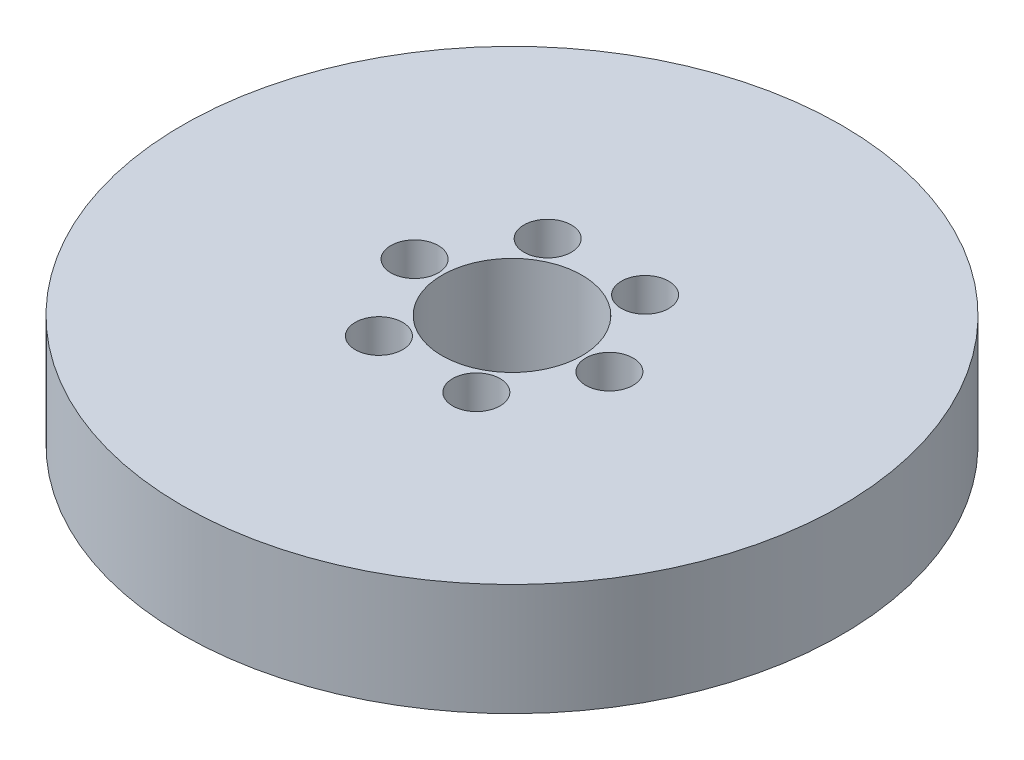
ISO-10303-21;
HEADER;
FILE_DESCRIPTION(('STEP AP214'),'2;1');
FILE_NAME('part.step','',(''),(''),'','','');
FILE_SCHEMA(('AUTOMOTIVE_DESIGN { 1 0 10303 214 1 1 1 1 }'));
ENDSEC;
DATA;
#1=APPLICATION_CONTEXT('core data for automotive mechanical design processes');
#2=APPLICATION_PROTOCOL_DEFINITION('international standard','automotive_design',2000,#1);
#3=PRODUCT_CONTEXT('',#1,'mechanical');
#4=PRODUCT('Part','Part','',(#3));
#5=PRODUCT_RELATED_PRODUCT_CATEGORY('part','',(#4));
#6=PRODUCT_DEFINITION_FORMATION('','',#4);
#7=PRODUCT_DEFINITION_CONTEXT('part definition',#1,'design');
#8=PRODUCT_DEFINITION('design','',#6,#7);
#9=PRODUCT_DEFINITION_SHAPE('','',#8);
#10=(LENGTH_UNIT() NAMED_UNIT(*) SI_UNIT(.MILLI.,.METRE.));
#11=(NAMED_UNIT(*) PLANE_ANGLE_UNIT() SI_UNIT($,.RADIAN.));
#12=(NAMED_UNIT(*) SI_UNIT($,.STERADIAN.) SOLID_ANGLE_UNIT());
#13=UNCERTAINTY_MEASURE_WITH_UNIT(LENGTH_MEASURE(1.E-05),#10,'distance_accuracy_value','');
#14=(GEOMETRIC_REPRESENTATION_CONTEXT(3) GLOBAL_UNCERTAINTY_ASSIGNED_CONTEXT((#13)) GLOBAL_UNIT_ASSIGNED_CONTEXT((#10,
#11,#12)) REPRESENTATION_CONTEXT('',''));
#15=CARTESIAN_POINT('',(0.,0.,0.));
#16=DIRECTION('',(0.,0.,1.));
#17=DIRECTION('',(1.,0.,0.));
#18=AXIS2_PLACEMENT_3D('',#15,#16,#17);
#19=CARTESIAN_POINT('',(0.,28.,0.));
#20=DIRECTION('',(0.,-1.,0.));
#21=DIRECTION('',(0.,0.,-1.));
#22=AXIS2_PLACEMENT_3D('',#19,#20,#21);
#23=CYLINDRICAL_SURFACE('',#22,82.5);
#24=CARTESIAN_POINT('',(0.,28.,0.));
#25=DIRECTION('',(0.,1.,0.));
#26=DIRECTION('',(0.,0.,1.));
#27=AXIS2_PLACEMENT_3D('',#24,#25,#26);
#28=CIRCLE('',#27,82.5);
#29=CARTESIAN_POINT('',(0.,28.,82.5));
#30=VERTEX_POINT('',#29);
#31=EDGE_CURVE('E10',#30,#30,#28,.T.);
#32=ORIENTED_EDGE('',*,*,#31,.F.);
#33=EDGE_LOOP('',(#32));
#34=FACE_BOUND('',#33,.T.);
#35=CARTESIAN_POINT('',(0.,0.,0.));
#36=DIRECTION('',(0.,1.,0.));
#37=DIRECTION('',(0.,0.,1.));
#38=AXIS2_PLACEMENT_3D('',#35,#36,#37);
#39=CIRCLE('',#38,82.5);
#40=CARTESIAN_POINT('',(0.,0.,82.5));
#41=VERTEX_POINT('',#40);
#42=EDGE_CURVE('E37',#41,#41,#39,.T.);
#43=ORIENTED_EDGE('',*,*,#42,.T.);
#44=EDGE_LOOP('',(#43));
#45=FACE_BOUND('',#44,.T.);
#46=ADVANCED_FACE('F40',(#34,#45),#23,.T.);
#47=CARTESIAN_POINT('',(0.,28.,0.));
#48=DIRECTION('',(0.,1.,0.));
#49=DIRECTION('',(0.,0.,1.));
#50=AXIS2_PLACEMENT_3D('',#47,#48,#49);
#51=PLANE('',#50);
#52=CARTESIAN_POINT('',(-12.1936646196493,28.,-21.1200466516871));
#53=DIRECTION('',(0.,1.,0.));
#54=DIRECTION('',(-0.866025403784433,0.,0.50000000000001));
#55=AXIS2_PLACEMENT_3D('',#52,#53,#54);
#56=CIRCLE('',#55,5.93664104178131);
#57=CARTESIAN_POINT('',(-17.3349465749812,28.,-18.1517261307964));
#58=VERTEX_POINT('',#57);
#59=EDGE_CURVE('E70',#58,#58,#56,.T.);
#60=ORIENTED_EDGE('',*,*,#59,.F.);
#61=EDGE_LOOP('',(#60));
#62=FACE_BOUND('',#61,.T.);
#63=CARTESIAN_POINT('',(12.1936646196489,28.,-21.1200466516873));
#64=DIRECTION('',(0.,1.,0.));
#65=DIRECTION('',(-0.866025403784443,0.,-0.499999999999992));
#66=AXIS2_PLACEMENT_3D('',#63,#64,#65);
#67=CIRCLE('',#66,5.93664104178131);
#68=CARTESIAN_POINT('',(7.05238266431691,28.,-24.0883671725779));
#69=VERTEX_POINT('',#68);
#70=EDGE_CURVE('E71',#69,#69,#67,.T.);
#71=ORIENTED_EDGE('',*,*,#70,.F.);
#72=EDGE_LOOP('',(#71));
#73=FACE_BOUND('',#72,.T.);
#74=CARTESIAN_POINT('',(24.3873292392981,28.,0.));
#75=DIRECTION('',(0.,1.,0.));
#76=DIRECTION('',(0.,0.,-1.));
#77=AXIS2_PLACEMENT_3D('',#74,#75,#76);
#78=CIRCLE('',#77,5.93664104178131);
#79=CARTESIAN_POINT('',(24.3873292392981,28.,-5.93664104178131));
#80=VERTEX_POINT('',#79);
#81=EDGE_CURVE('E78',#80,#80,#78,.T.);
#82=ORIENTED_EDGE('',*,*,#81,.F.);
#83=EDGE_LOOP('',(#82));
#84=FACE_BOUND('',#83,.T.);
#85=CARTESIAN_POINT('',(12.1936646196492,28.,21.1200466516872));
#86=DIRECTION('',(0.,1.,0.));
#87=DIRECTION('',(0.866025403784436,0.,-0.500000000000004));
#88=AXIS2_PLACEMENT_3D('',#85,#86,#87);
#89=CIRCLE('',#88,5.93664104178131);
#90=CARTESIAN_POINT('',(17.3349465749811,28.,18.1517261307965));
#91=VERTEX_POINT('',#90);
#92=EDGE_CURVE('E84',#91,#91,#89,.T.);
#93=ORIENTED_EDGE('',*,*,#92,.F.);
#94=EDGE_LOOP('',(#93));
#95=FACE_BOUND('',#94,.T.);
#96=CARTESIAN_POINT('',(-12.193664619649,28.,21.1200466516872));
#97=DIRECTION('',(0.,1.,0.));
#98=DIRECTION('',(0.86602540378444,0.,0.499999999999998));
#99=AXIS2_PLACEMENT_3D('',#96,#97,#98);
#100=CIRCLE('',#99,5.93664104178131);
#101=CARTESIAN_POINT('',(-7.05238266431708,28.,24.0883671725779));
#102=VERTEX_POINT('',#101);
#103=EDGE_CURVE('E61',#102,#102,#100,.T.);
#104=ORIENTED_EDGE('',*,*,#103,.F.);
#105=EDGE_LOOP('',(#104));
#106=FACE_BOUND('',#105,.T.);
#107=CARTESIAN_POINT('',(-24.3873292392981,28.,0.));
#108=DIRECTION('',(0.,1.,0.));
#109=DIRECTION('',(0.,0.,1.));
#110=AXIS2_PLACEMENT_3D('',#107,#108,#109);
#111=CIRCLE('',#110,5.93664104178131);
#112=CARTESIAN_POINT('',(-24.3873292392981,28.,5.93664104178131));
#113=VERTEX_POINT('',#112);
#114=EDGE_CURVE('E54',#113,#113,#111,.T.);
#115=ORIENTED_EDGE('',*,*,#114,.F.);
#116=EDGE_LOOP('',(#115));
#117=FACE_BOUND('',#116,.T.);
#118=CARTESIAN_POINT('',(0.,28.,0.));
#119=DIRECTION('',(0.,1.,0.));
#120=DIRECTION('',(0.,0.,1.));
#121=AXIS2_PLACEMENT_3D('',#118,#119,#120);
#122=CIRCLE('',#121,17.5);
#123=CARTESIAN_POINT('',(0.,28.,17.5));
#124=VERTEX_POINT('',#123);
#125=EDGE_CURVE('E50',#124,#124,#122,.T.);
#126=ORIENTED_EDGE('',*,*,#125,.F.);
#127=EDGE_LOOP('',(#126));
#128=FACE_BOUND('',#127,.T.);
#129=ORIENTED_EDGE('',*,*,#31,.T.);
#130=EDGE_LOOP('',(#129));
#131=FACE_BOUND('',#130,.T.);
#132=ADVANCED_FACE('F99',(#62,#73,#84,#95,#106,#117,#128,#131),#51,.T.);
#133=CARTESIAN_POINT('',(0.,0.,0.));
#134=DIRECTION('',(0.,1.,0.));
#135=DIRECTION('',(0.,0.,1.));
#136=AXIS2_PLACEMENT_3D('',#133,#134,#135);
#137=PLANE('',#136);
#138=CARTESIAN_POINT('',(0.,0.,0.));
#139=DIRECTION('',(0.,1.,0.));
#140=DIRECTION('',(0.,0.,1.));
#141=AXIS2_PLACEMENT_3D('',#138,#139,#140);
#142=CIRCLE('',#141,17.5);
#143=CARTESIAN_POINT('',(0.,0.,17.5));
#144=VERTEX_POINT('',#143);
#145=EDGE_CURVE('E47',#144,#144,#142,.T.);
#146=ORIENTED_EDGE('',*,*,#145,.T.);
#147=EDGE_LOOP('',(#146));
#148=FACE_BOUND('',#147,.T.);
#149=ORIENTED_EDGE('',*,*,#42,.F.);
#150=EDGE_LOOP('',(#149));
#151=FACE_BOUND('',#150,.T.);
#152=ADVANCED_FACE('F103',(#148,#151),#137,.F.);
#153=CARTESIAN_POINT('',(0.,28.,0.));
#154=DIRECTION('',(0.,-1.,0.));
#155=DIRECTION('',(0.,0.,-1.));
#156=AXIS2_PLACEMENT_3D('',#153,#154,#155);
#157=CYLINDRICAL_SURFACE('',#156,17.5);
#158=ORIENTED_EDGE('',*,*,#125,.T.);
#159=EDGE_LOOP('',(#158));
#160=FACE_BOUND('',#159,.T.);
#161=ORIENTED_EDGE('',*,*,#145,.F.);
#162=EDGE_LOOP('',(#161));
#163=FACE_BOUND('',#162,.T.);
#164=ADVANCED_FACE('F115',(#160,#163),#157,.F.);
#165=CARTESIAN_POINT('',(-24.3873292392981,9.53232784157378,0.));
#166=DIRECTION('',(0.,1.,0.));
#167=DIRECTION('',(0.,0.,1.));
#168=AXIS2_PLACEMENT_3D('',#165,#166,#167);
#169=CYLINDRICAL_SURFACE('',#168,5.93664104178131);
#170=CARTESIAN_POINT('',(-24.3873292392981,9.53232784157378,0.));
#171=DIRECTION('',(0.,1.,0.));
#172=DIRECTION('',(0.,0.,1.));
#173=AXIS2_PLACEMENT_3D('',#170,#171,#172);
#174=CIRCLE('',#173,5.93664104178131);
#175=CARTESIAN_POINT('',(-24.3873292392981,9.53232784157378,5.93664104178131));
#176=VERTEX_POINT('',#175);
#177=EDGE_CURVE('E55',#176,#176,#174,.T.);
#178=ORIENTED_EDGE('',*,*,#177,.F.);
#179=EDGE_LOOP('',(#178));
#180=FACE_BOUND('',#179,.T.);
#181=ORIENTED_EDGE('',*,*,#114,.T.);
#182=EDGE_LOOP('',(#181));
#183=FACE_BOUND('',#182,.T.);
#184=ADVANCED_FACE('F113',(#180,#183),#169,.F.);
#185=CARTESIAN_POINT('',(-24.3873292392981,9.53232784157378,0.));
#186=DIRECTION('',(0.,1.,0.));
#187=DIRECTION('',(0.,0.,1.));
#188=AXIS2_PLACEMENT_3D('',#185,#186,#187);
#189=PLANE('',#188);
#190=ORIENTED_EDGE('',*,*,#177,.T.);
#191=EDGE_LOOP('',(#190));
#192=FACE_BOUND('',#191,.T.);
#193=ADVANCED_FACE('F144',(#192),#189,.T.);
#194=CARTESIAN_POINT('',(-12.193664619649,9.53232784157378,21.1200466516872));
#195=DIRECTION('',(0.,1.,0.));
#196=DIRECTION('',(0.,0.,1.));
#197=AXIS2_PLACEMENT_3D('',#194,#195,#196);
#198=CYLINDRICAL_SURFACE('',#197,5.93664104178131);
#199=CARTESIAN_POINT('',(-12.193664619649,9.53232784157378,21.1200466516872));
#200=DIRECTION('',(0.,1.,0.));
#201=DIRECTION('',(0.86602540378444,0.,0.499999999999998));
#202=AXIS2_PLACEMENT_3D('',#199,#200,#201);
#203=CIRCLE('',#202,5.93664104178131);
#204=CARTESIAN_POINT('',(-7.05238266431708,9.53232784157378,24.0883671725779));
#205=VERTEX_POINT('',#204);
#206=EDGE_CURVE('E59',#205,#205,#203,.T.);
#207=ORIENTED_EDGE('',*,*,#206,.F.);
#208=EDGE_LOOP('',(#207));
#209=FACE_BOUND('',#208,.T.);
#210=ORIENTED_EDGE('',*,*,#103,.T.);
#211=EDGE_LOOP('',(#210));
#212=FACE_BOUND('',#211,.T.);
#213=ADVANCED_FACE('F153',(#209,#212),#198,.F.);
#214=CARTESIAN_POINT('',(-12.193664619649,9.53232784157378,21.1200466516872));
#215=DIRECTION('',(0.,1.,0.));
#216=DIRECTION('',(0.86602540378444,0.,0.499999999999998));
#217=AXIS2_PLACEMENT_3D('',#214,#215,#216);
#218=PLANE('',#217);
#219=ORIENTED_EDGE('',*,*,#206,.T.);
#220=EDGE_LOOP('',(#219));
#221=FACE_BOUND('',#220,.T.);
#222=ADVANCED_FACE('F96',(#221),#218,.T.);
#223=CARTESIAN_POINT('',(12.1936646196492,9.53232784157378,21.1200466516872));
#224=DIRECTION('',(0.,1.,0.));
#225=DIRECTION('',(0.,0.,1.));
#226=AXIS2_PLACEMENT_3D('',#223,#224,#225);
#227=CYLINDRICAL_SURFACE('',#226,5.93664104178131);
#228=CARTESIAN_POINT('',(12.1936646196492,9.53232784157378,21.1200466516872));
#229=DIRECTION('',(0.,1.,0.));
#230=DIRECTION('',(0.866025403784436,0.,-0.500000000000004));
#231=AXIS2_PLACEMENT_3D('',#228,#229,#230);
#232=CIRCLE('',#231,5.93664104178131);
#233=CARTESIAN_POINT('',(17.3349465749811,9.53232784157378,18.1517261307965));
#234=VERTEX_POINT('',#233);
#235=EDGE_CURVE('E63',#234,#234,#232,.T.);
#236=ORIENTED_EDGE('',*,*,#235,.F.);
#237=EDGE_LOOP('',(#236));
#238=FACE_BOUND('',#237,.T.);
#239=ORIENTED_EDGE('',*,*,#92,.T.);
#240=EDGE_LOOP('',(#239));
#241=FACE_BOUND('',#240,.T.);
#242=ADVANCED_FACE('F91',(#238,#241),#227,.F.);
#243=CARTESIAN_POINT('',(12.1936646196492,9.53232784157378,21.1200466516872));
#244=DIRECTION('',(0.,1.,0.));
#245=DIRECTION('',(0.866025403784436,0.,-0.500000000000004));
#246=AXIS2_PLACEMENT_3D('',#243,#244,#245);
#247=PLANE('',#246);
#248=ORIENTED_EDGE('',*,*,#235,.T.);
#249=EDGE_LOOP('',(#248));
#250=FACE_BOUND('',#249,.T.);
#251=ADVANCED_FACE('F93',(#250),#247,.T.);
#252=CARTESIAN_POINT('',(24.3873292392981,9.53232784157378,0.));
#253=DIRECTION('',(0.,1.,0.));
#254=DIRECTION('',(0.,0.,1.));
#255=AXIS2_PLACEMENT_3D('',#252,#253,#254);
#256=CYLINDRICAL_SURFACE('',#255,5.93664104178131);
#257=CARTESIAN_POINT('',(24.3873292392981,9.53232784157378,0.));
#258=DIRECTION('',(0.,1.,0.));
#259=DIRECTION('',(0.,0.,-1.));
#260=AXIS2_PLACEMENT_3D('',#257,#258,#259);
#261=CIRCLE('',#260,5.93664104178131);
#262=CARTESIAN_POINT('',(24.3873292392981,9.53232784157378,-5.93664104178131));
#263=VERTEX_POINT('',#262);
#264=EDGE_CURVE('E85',#263,#263,#261,.T.);
#265=ORIENTED_EDGE('',*,*,#264,.F.);
#266=EDGE_LOOP('',(#265));
#267=FACE_BOUND('',#266,.T.);
#268=ORIENTED_EDGE('',*,*,#81,.T.);
#269=EDGE_LOOP('',(#268));
#270=FACE_BOUND('',#269,.T.);
#271=ADVANCED_FACE('F187',(#267,#270),#256,.F.);
#272=CARTESIAN_POINT('',(24.3873292392981,9.53232784157378,0.));
#273=DIRECTION('',(0.,1.,0.));
#274=DIRECTION('',(0.,0.,-1.));
#275=AXIS2_PLACEMENT_3D('',#272,#273,#274);
#276=PLANE('',#275);
#277=ORIENTED_EDGE('',*,*,#264,.T.);
#278=EDGE_LOOP('',(#277));
#279=FACE_BOUND('',#278,.T.);
#280=ADVANCED_FACE('F198',(#279),#276,.T.);
#281=CARTESIAN_POINT('',(12.1936646196489,9.53232784157378,-21.1200466516873));
#282=DIRECTION('',(0.,1.,0.));
#283=DIRECTION('',(0.,0.,1.));
#284=AXIS2_PLACEMENT_3D('',#281,#282,#283);
#285=CYLINDRICAL_SURFACE('',#284,5.93664104178131);
#286=CARTESIAN_POINT('',(12.1936646196489,9.53232784157378,-21.1200466516873));
#287=DIRECTION('',(0.,1.,0.));
#288=DIRECTION('',(-0.866025403784443,0.,-0.499999999999992));
#289=AXIS2_PLACEMENT_3D('',#286,#287,#288);
#290=CIRCLE('',#289,5.93664104178131);
#291=CARTESIAN_POINT('',(7.05238266431691,9.53232784157378,-24.0883671725779));
#292=VERTEX_POINT('',#291);
#293=EDGE_CURVE('E76',#292,#292,#290,.T.);
#294=ORIENTED_EDGE('',*,*,#293,.F.);
#295=EDGE_LOOP('',(#294));
#296=FACE_BOUND('',#295,.T.);
#297=ORIENTED_EDGE('',*,*,#70,.T.);
#298=EDGE_LOOP('',(#297));
#299=FACE_BOUND('',#298,.T.);
#300=ADVANCED_FACE('F202',(#296,#299),#285,.F.);
#301=CARTESIAN_POINT('',(12.1936646196489,9.53232784157378,-21.1200466516873));
#302=DIRECTION('',(0.,1.,0.));
#303=DIRECTION('',(-0.866025403784443,0.,-0.499999999999992));
#304=AXIS2_PLACEMENT_3D('',#301,#302,#303);
#305=PLANE('',#304);
#306=ORIENTED_EDGE('',*,*,#293,.T.);
#307=EDGE_LOOP('',(#306));
#308=FACE_BOUND('',#307,.T.);
#309=ADVANCED_FACE('F212',(#308),#305,.T.);
#310=CARTESIAN_POINT('',(-12.1936646196493,9.53232784157378,-21.1200466516871));
#311=DIRECTION('',(0.,1.,0.));
#312=DIRECTION('',(0.,0.,1.));
#313=AXIS2_PLACEMENT_3D('',#310,#311,#312);
#314=CYLINDRICAL_SURFACE('',#313,5.93664104178131);
#315=CARTESIAN_POINT('',(-12.1936646196493,9.53232784157378,-21.1200466516871));
#316=DIRECTION('',(0.,1.,0.));
#317=DIRECTION('',(-0.866025403784433,0.,0.50000000000001));
#318=AXIS2_PLACEMENT_3D('',#315,#316,#317);
#319=CIRCLE('',#318,5.93664104178131);
#320=CARTESIAN_POINT('',(-17.3349465749812,9.53232784157378,-18.1517261307964));
#321=VERTEX_POINT('',#320);
#322=EDGE_CURVE('E69',#321,#321,#319,.T.);
#323=ORIENTED_EDGE('',*,*,#322,.F.);
#324=EDGE_LOOP('',(#323));
#325=FACE_BOUND('',#324,.T.);
#326=ORIENTED_EDGE('',*,*,#59,.T.);
#327=EDGE_LOOP('',(#326));
#328=FACE_BOUND('',#327,.T.);
#329=ADVANCED_FACE('F224',(#325,#328),#314,.F.);
#330=CARTESIAN_POINT('',(-12.1936646196493,9.53232784157378,-21.1200466516871));
#331=DIRECTION('',(0.,1.,0.));
#332=DIRECTION('',(-0.866025403784433,0.,0.50000000000001));
#333=AXIS2_PLACEMENT_3D('',#330,#331,#332);
#334=PLANE('',#333);
#335=ORIENTED_EDGE('',*,*,#322,.T.);
#336=EDGE_LOOP('',(#335));
#337=FACE_BOUND('',#336,.T.);
#338=ADVANCED_FACE('F235',(#337),#334,.T.);
#339=CLOSED_SHELL('',(#46,#132,#152,#164,#184,#193,#213,#222,#242,#251,#271,#280,#300,#309,#329,#338));
#340=MANIFOLD_SOLID_BREP('B2',#339);
#341=ADVANCED_BREP_SHAPE_REPRESENTATION('',(#18,#340),#14);
#342=SHAPE_DEFINITION_REPRESENTATION(#9,#341);
ENDSEC;
END-ISO-10303-21;
